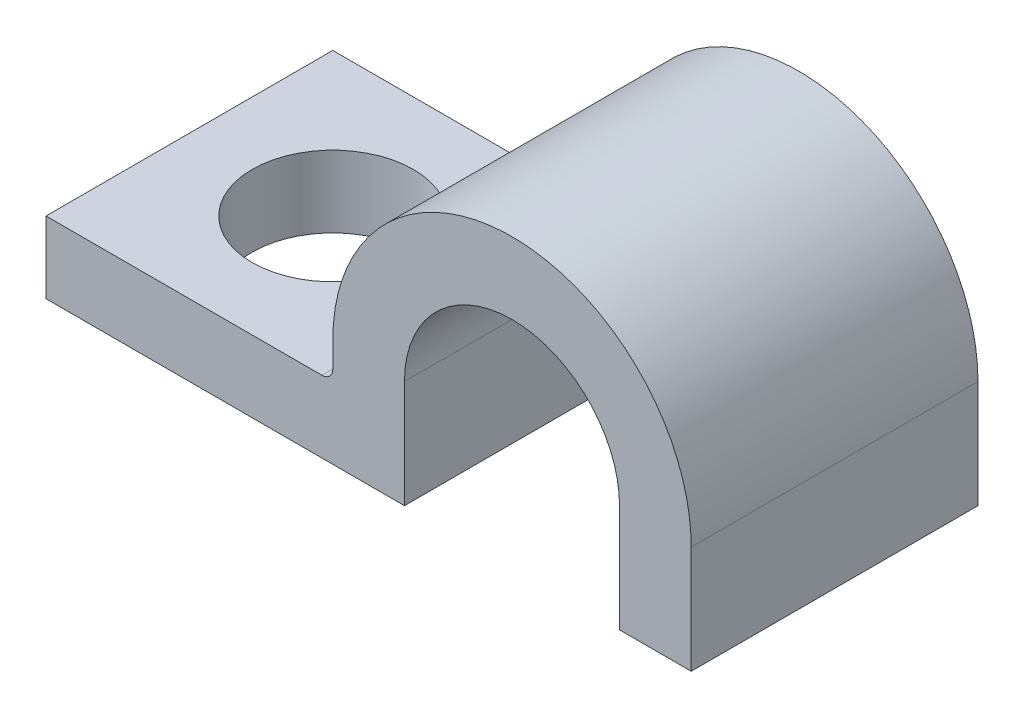
ISO-10303-21;
HEADER;
FILE_DESCRIPTION(('STEP AP214'),'2;1');
FILE_NAME('part.step','',(''),(''),'','','');
FILE_SCHEMA(('AUTOMOTIVE_DESIGN { 1 0 10303 214 1 1 1 1 }'));
ENDSEC;
DATA;
#1=APPLICATION_CONTEXT('core data for automotive mechanical design processes');
#2=APPLICATION_PROTOCOL_DEFINITION('international standard','automotive_design',2000,#1);
#3=PRODUCT_CONTEXT('',#1,'mechanical');
#4=PRODUCT('Part','Part','',(#3));
#5=PRODUCT_RELATED_PRODUCT_CATEGORY('part','',(#4));
#6=PRODUCT_DEFINITION_FORMATION('','',#4);
#7=PRODUCT_DEFINITION_CONTEXT('part definition',#1,'design');
#8=PRODUCT_DEFINITION('design','',#6,#7);
#9=PRODUCT_DEFINITION_SHAPE('','',#8);
#10=(LENGTH_UNIT() NAMED_UNIT(*) SI_UNIT(.MILLI.,.METRE.));
#11=(NAMED_UNIT(*) PLANE_ANGLE_UNIT() SI_UNIT($,.RADIAN.));
#12=(NAMED_UNIT(*) SI_UNIT($,.STERADIAN.) SOLID_ANGLE_UNIT());
#13=UNCERTAINTY_MEASURE_WITH_UNIT(LENGTH_MEASURE(1.E-05),#10,'distance_accuracy_value','');
#14=(GEOMETRIC_REPRESENTATION_CONTEXT(3) GLOBAL_UNCERTAINTY_ASSIGNED_CONTEXT((#13)) GLOBAL_UNIT_ASSIGNED_CONTEXT((#10,
#11,#12)) REPRESENTATION_CONTEXT('',''));
#15=CARTESIAN_POINT('',(0.,0.,0.));
#16=DIRECTION('',(0.,0.,1.));
#17=DIRECTION('',(1.,0.,0.));
#18=AXIS2_PLACEMENT_3D('',#15,#16,#17);
#19=CARTESIAN_POINT('',(0.,0.,7.99999999999995));
#20=DIRECTION('',(1.,0.,0.));
#21=DIRECTION('',(0.,0.,-1.));
#22=AXIS2_PLACEMENT_3D('',#19,#20,#21);
#23=PLANE('',#22);
#24=DIRECTION('',(0.,-1.,0.));
#25=VECTOR('',#24,1.);
#26=CARTESIAN_POINT('',(0.,0.,0.));
#27=LINE('',#26,#25);
#28=CARTESIAN_POINT('',(0.,1.99999999999989,0.));
#29=VERTEX_POINT('',#28);
#30=CARTESIAN_POINT('',(0.,0.,0.));
#31=VERTEX_POINT('',#30);
#32=EDGE_CURVE('E115',#29,#31,#27,.T.);
#33=ORIENTED_EDGE('',*,*,#32,.T.);
#34=DIRECTION('',(0.,0.,-1.));
#35=VECTOR('',#34,1.);
#36=CARTESIAN_POINT('',(0.,0.,7.99999999999995));
#37=LINE('',#36,#35);
#38=CARTESIAN_POINT('',(0.,0.,7.99999999999995));
#39=VERTEX_POINT('',#38);
#40=EDGE_CURVE('E123',#39,#31,#37,.T.);
#41=ORIENTED_EDGE('',*,*,#40,.F.);
#42=DIRECTION('',(0.,-1.,0.));
#43=VECTOR('',#42,1.);
#44=CARTESIAN_POINT('',(0.,0.,7.99999999999995));
#45=LINE('',#44,#43);
#46=CARTESIAN_POINT('',(0.,1.9999999999999,7.99999999999995));
#47=VERTEX_POINT('',#46);
#48=EDGE_CURVE('E157',#47,#39,#45,.T.);
#49=ORIENTED_EDGE('',*,*,#48,.F.);
#50=DIRECTION('',(0.,0.,-1.));
#51=VECTOR('',#50,1.);
#52=CARTESIAN_POINT('',(0.,1.9999999999999,7.99999999999995));
#53=LINE('',#52,#51);
#54=EDGE_CURVE('E134',#47,#29,#53,.T.);
#55=ORIENTED_EDGE('',*,*,#54,.T.);
#56=EDGE_LOOP('',(#33,#41,#49,#55));
#57=FACE_BOUND('',#56,.T.);
#58=ADVANCED_FACE('F30',(#57),#23,.F.);
#59=CARTESIAN_POINT('',(0.,0.,7.99999999999995));
#60=DIRECTION('',(0.,1.,0.));
#61=DIRECTION('',(-1.,0.,0.));
#62=AXIS2_PLACEMENT_3D('',#59,#60,#61);
#63=PLANE('',#62);
#64=CARTESIAN_POINT('',(4.00000000000001,0.,4.));
#65=DIRECTION('',(0.,1.,0.));
#66=DIRECTION('',(-1.,0.,0.));
#67=AXIS2_PLACEMENT_3D('',#64,#65,#66);
#68=CIRCLE('',#67,2.25);
#69=CARTESIAN_POINT('',(1.75000000000001,0.,4.));
#70=VERTEX_POINT('',#69);
#71=EDGE_CURVE('E135',#70,#70,#68,.T.);
#72=ORIENTED_EDGE('',*,*,#71,.T.);
#73=EDGE_LOOP('',(#72));
#74=FACE_BOUND('',#73,.T.);
#75=DIRECTION('',(1.,0.,0.));
#76=VECTOR('',#75,1.);
#77=CARTESIAN_POINT('',(0.,0.,0.));
#78=LINE('',#77,#76);
#79=CARTESIAN_POINT('',(10.,0.,0.));
#80=VERTEX_POINT('',#79);
#81=EDGE_CURVE('E111',#31,#80,#78,.T.);
#82=ORIENTED_EDGE('',*,*,#81,.T.);
#83=DIRECTION('',(0.,0.,-1.));
#84=VECTOR('',#83,1.);
#85=CARTESIAN_POINT('',(9.99999999999998,0.,8.00000000000006));
#86=LINE('',#85,#84);
#87=CARTESIAN_POINT('',(9.99999999999998,0.,8.00000000000006));
#88=VERTEX_POINT('',#87);
#89=EDGE_CURVE('E130',#88,#80,#86,.T.);
#90=ORIENTED_EDGE('',*,*,#89,.F.);
#91=DIRECTION('',(1.,0.,0.));
#92=VECTOR('',#91,1.);
#93=CARTESIAN_POINT('',(0.,0.,7.99999999999995));
#94=LINE('',#93,#92);
#95=EDGE_CURVE('E125',#39,#88,#94,.T.);
#96=ORIENTED_EDGE('',*,*,#95,.F.);
#97=ORIENTED_EDGE('',*,*,#40,.T.);
#98=EDGE_LOOP('',(#82,#90,#96,#97));
#99=FACE_BOUND('',#98,.T.);
#100=ADVANCED_FACE('F124',(#74,#99),#63,.F.);
#101=CARTESIAN_POINT('',(9.99999999999998,0.,8.00000000000006));
#102=DIRECTION('',(-1.,0.,0.));
#103=DIRECTION('',(0.,-1.,0.));
#104=AXIS2_PLACEMENT_3D('',#101,#102,#103);
#105=PLANE('',#104);
#106=DIRECTION('',(0.,1.,0.));
#107=VECTOR('',#106,1.);
#108=CARTESIAN_POINT('',(10.,0.,0.));
#109=LINE('',#108,#107);
#110=CARTESIAN_POINT('',(10.,2.99999999999992,0.));
#111=VERTEX_POINT('',#110);
#112=EDGE_CURVE('E117',#80,#111,#109,.T.);
#113=ORIENTED_EDGE('',*,*,#112,.T.);
#114=DIRECTION('',(0.,0.,-1.));
#115=VECTOR('',#114,1.);
#116=CARTESIAN_POINT('',(10.,2.99999999999992,7.99999999999998));
#117=LINE('',#116,#115);
#118=CARTESIAN_POINT('',(10.,2.99999999999992,7.99999999999998));
#119=VERTEX_POINT('',#118);
#120=EDGE_CURVE('E192',#119,#111,#117,.T.);
#121=ORIENTED_EDGE('',*,*,#120,.F.);
#122=DIRECTION('',(0.,1.,0.));
#123=VECTOR('',#122,1.);
#124=CARTESIAN_POINT('',(9.99999999999998,0.,8.00000000000006));
#125=LINE('',#124,#123);
#126=EDGE_CURVE('E160',#88,#119,#125,.T.);
#127=ORIENTED_EDGE('',*,*,#126,.F.);
#128=ORIENTED_EDGE('',*,*,#89,.T.);
#129=EDGE_LOOP('',(#113,#121,#127,#128));
#130=FACE_BOUND('',#129,.T.);
#131=ADVANCED_FACE('F235',(#130),#105,.F.);
#132=CARTESIAN_POINT('',(13.,2.99999999999992,8.00000000000009));
#133=DIRECTION('',(0.,0.,-1.));
#134=DIRECTION('',(-1.,0.,0.));
#135=AXIS2_PLACEMENT_3D('',#132,#133,#134);
#136=CYLINDRICAL_SURFACE('',#135,3.);
#137=CARTESIAN_POINT('',(13.,2.99999999999998,0.));
#138=DIRECTION('',(0.,0.,-1.));
#139=DIRECTION('',(-1.,0.,0.));
#140=AXIS2_PLACEMENT_3D('',#137,#138,#139);
#141=CIRCLE('',#140,3.);
#142=CARTESIAN_POINT('',(16.,2.99999999999992,0.));
#143=VERTEX_POINT('',#142);
#144=EDGE_CURVE('E143',#111,#143,#141,.T.);
#145=ORIENTED_EDGE('',*,*,#144,.T.);
#146=DIRECTION('',(0.,0.,-1.));
#147=VECTOR('',#146,1.);
#148=CARTESIAN_POINT('',(16.,2.99999999999992,8.00000000000002));
#149=LINE('',#148,#147);
#150=CARTESIAN_POINT('',(16.,2.99999999999992,8.00000000000002));
#151=VERTEX_POINT('',#150);
#152=EDGE_CURVE('E189',#151,#143,#149,.T.);
#153=ORIENTED_EDGE('',*,*,#152,.F.);
#154=CARTESIAN_POINT('',(13.,2.99999999999992,8.00000000000009));
#155=DIRECTION('',(0.,0.,-1.));
#156=DIRECTION('',(-1.,0.,0.));
#157=AXIS2_PLACEMENT_3D('',#154,#155,#156);
#158=CIRCLE('',#157,3.);
#159=EDGE_CURVE('E162',#119,#151,#158,.T.);
#160=ORIENTED_EDGE('',*,*,#159,.F.);
#161=ORIENTED_EDGE('',*,*,#120,.T.);
#162=EDGE_LOOP('',(#145,#153,#160,#161));
#163=FACE_BOUND('',#162,.T.);
#164=ADVANCED_FACE('F231',(#163),#136,.F.);
#165=CARTESIAN_POINT('',(16.,2.99999999999992,8.00000000000002));
#166=DIRECTION('',(1.,0.,0.));
#167=DIRECTION('',(0.,0.,-1.));
#168=AXIS2_PLACEMENT_3D('',#165,#166,#167);
#169=PLANE('',#168);
#170=DIRECTION('',(0.,-1.,0.));
#171=VECTOR('',#170,1.);
#172=CARTESIAN_POINT('',(16.,2.99999999999992,0.));
#173=LINE('',#172,#171);
#174=CARTESIAN_POINT('',(16.,-1.2490009027033E-13,0.));
#175=VERTEX_POINT('',#174);
#176=EDGE_CURVE('E145',#143,#175,#173,.T.);
#177=ORIENTED_EDGE('',*,*,#176,.T.);
#178=DIRECTION('',(0.,0.,-1.));
#179=VECTOR('',#178,1.);
#180=CARTESIAN_POINT('',(16.,-1.2490009027033E-13,8.00000000000005));
#181=LINE('',#180,#179);
#182=CARTESIAN_POINT('',(16.,-1.2490009027033E-13,8.00000000000005));
#183=VERTEX_POINT('',#182);
#184=EDGE_CURVE('E186',#183,#175,#181,.T.);
#185=ORIENTED_EDGE('',*,*,#184,.F.);
#186=DIRECTION('',(0.,-1.,0.));
#187=VECTOR('',#186,1.);
#188=CARTESIAN_POINT('',(16.,2.99999999999992,8.00000000000002));
#189=LINE('',#188,#187);
#190=EDGE_CURVE('E164',#151,#183,#189,.T.);
#191=ORIENTED_EDGE('',*,*,#190,.F.);
#192=ORIENTED_EDGE('',*,*,#152,.T.);
#193=EDGE_LOOP('',(#177,#185,#191,#192));
#194=FACE_BOUND('',#193,.T.);
#195=ADVANCED_FACE('F226',(#194),#169,.F.);
#196=CARTESIAN_POINT('',(18.,0.,8.00000000000006));
#197=DIRECTION('',(0.,1.,0.));
#198=DIRECTION('',(-1.,0.,0.));
#199=AXIS2_PLACEMENT_3D('',#196,#197,#198);
#200=PLANE('',#199);
#201=DIRECTION('',(1.,0.,0.));
#202=VECTOR('',#201,1.);
#203=CARTESIAN_POINT('',(18.,0.,0.));
#204=LINE('',#203,#202);
#205=CARTESIAN_POINT('',(18.,0.,0.));
#206=VERTEX_POINT('',#205);
#207=EDGE_CURVE('E147',#175,#206,#204,.T.);
#208=ORIENTED_EDGE('',*,*,#207,.T.);
#209=DIRECTION('',(0.,0.,-1.));
#210=VECTOR('',#209,1.);
#211=CARTESIAN_POINT('',(18.,0.,8.00000000000006));
#212=LINE('',#211,#210);
#213=CARTESIAN_POINT('',(18.,0.,8.00000000000006));
#214=VERTEX_POINT('',#213);
#215=EDGE_CURVE('E183',#214,#206,#212,.T.);
#216=ORIENTED_EDGE('',*,*,#215,.F.);
#217=DIRECTION('',(1.,0.,0.));
#218=VECTOR('',#217,1.);
#219=CARTESIAN_POINT('',(18.,0.,8.00000000000006));
#220=LINE('',#219,#218);
#221=EDGE_CURVE('E166',#183,#214,#220,.T.);
#222=ORIENTED_EDGE('',*,*,#221,.F.);
#223=ORIENTED_EDGE('',*,*,#184,.T.);
#224=EDGE_LOOP('',(#208,#216,#222,#223));
#225=FACE_BOUND('',#224,.T.);
#226=ADVANCED_FACE('F222',(#225),#200,.F.);
#227=CARTESIAN_POINT('',(18.,2.99999999999995,7.99999999999999));
#228=DIRECTION('',(-1.,0.,0.));
#229=DIRECTION('',(0.,-1.,0.));
#230=AXIS2_PLACEMENT_3D('',#227,#228,#229);
#231=PLANE('',#230);
#232=DIRECTION('',(0.,1.,0.));
#233=VECTOR('',#232,1.);
#234=CARTESIAN_POINT('',(18.0000000000001,2.99999999999998,0.));
#235=LINE('',#234,#233);
#236=CARTESIAN_POINT('',(18.0000000000001,2.99999999999998,0.));
#237=VERTEX_POINT('',#236);
#238=EDGE_CURVE('E149',#206,#237,#235,.T.);
#239=ORIENTED_EDGE('',*,*,#238,.T.);
#240=DIRECTION('',(0.,0.,-1.));
#241=VECTOR('',#240,1.);
#242=CARTESIAN_POINT('',(18.,2.99999999999995,7.99999999999999));
#243=LINE('',#242,#241);
#244=CARTESIAN_POINT('',(18.,2.99999999999995,7.99999999999999));
#245=VERTEX_POINT('',#244);
#246=EDGE_CURVE('E180',#245,#237,#243,.T.);
#247=ORIENTED_EDGE('',*,*,#246,.F.);
#248=DIRECTION('',(0.,1.,0.));
#249=VECTOR('',#248,1.);
#250=CARTESIAN_POINT('',(18.,2.99999999999995,7.99999999999999));
#251=LINE('',#250,#249);
#252=EDGE_CURVE('E168',#214,#245,#251,.T.);
#253=ORIENTED_EDGE('',*,*,#252,.F.);
#254=ORIENTED_EDGE('',*,*,#215,.T.);
#255=EDGE_LOOP('',(#239,#247,#253,#254));
#256=FACE_BOUND('',#255,.T.);
#257=ADVANCED_FACE('F218',(#256),#231,.F.);
#258=CARTESIAN_POINT('',(13.,2.99999999999992,8.00000000000009));
#259=DIRECTION('',(0.,0.,-1.));
#260=DIRECTION('',(-1.,0.,0.));
#261=AXIS2_PLACEMENT_3D('',#258,#259,#260);
#262=CYLINDRICAL_SURFACE('',#261,5.);
#263=CARTESIAN_POINT('',(13.,2.99999999999998,0.));
#264=DIRECTION('',(0.,0.,1.));
#265=DIRECTION('',(-1.,0.,0.));
#266=AXIS2_PLACEMENT_3D('',#263,#264,#265);
#267=CIRCLE('',#266,5.);
#268=CARTESIAN_POINT('',(8.,2.99999999999999,0.));
#269=VERTEX_POINT('',#268);
#270=EDGE_CURVE('E151',#237,#269,#267,.T.);
#271=ORIENTED_EDGE('',*,*,#270,.T.);
#272=DIRECTION('',(0.,0.,-1.));
#273=VECTOR('',#272,1.);
#274=CARTESIAN_POINT('',(8.00000000000003,2.99999999999999,7.99999999999995));
#275=LINE('',#274,#273);
#276=CARTESIAN_POINT('',(8.00000000000003,2.99999999999999,7.99999999999995));
#277=VERTEX_POINT('',#276);
#278=EDGE_CURVE('E177',#277,#269,#275,.T.);
#279=ORIENTED_EDGE('',*,*,#278,.F.);
#280=CARTESIAN_POINT('',(13.,2.99999999999992,8.00000000000009));
#281=DIRECTION('',(0.,0.,1.));
#282=DIRECTION('',(-1.,0.,0.));
#283=AXIS2_PLACEMENT_3D('',#280,#281,#282);
#284=CIRCLE('',#283,5.);
#285=EDGE_CURVE('E170',#245,#277,#284,.T.);
#286=ORIENTED_EDGE('',*,*,#285,.F.);
#287=ORIENTED_EDGE('',*,*,#246,.T.);
#288=EDGE_LOOP('',(#271,#279,#286,#287));
#289=FACE_BOUND('',#288,.T.);
#290=ADVANCED_FACE('F214',(#289),#262,.T.);
#291=CARTESIAN_POINT('',(8.00000000000004,1.99999999999996,7.99999999999998));
#292=DIRECTION('',(1.,0.,0.));
#293=DIRECTION('',(0.,1.,0.));
#294=AXIS2_PLACEMENT_3D('',#291,#292,#293);
#295=PLANE('',#294);
#296=DIRECTION('',(0.,-1.,0.));
#297=VECTOR('',#296,1.);
#298=CARTESIAN_POINT('',(8.00000000000004,1.99999999999997,0.));
#299=LINE('',#298,#297);
#300=CARTESIAN_POINT('',(8.00000000000004,2.2999999999999,0.));
#301=VERTEX_POINT('',#300);
#302=EDGE_CURVE('E153',#269,#301,#299,.T.);
#303=ORIENTED_EDGE('',*,*,#302,.T.);
#304=DIRECTION('',(0.,0.,-1.));
#305=VECTOR('',#304,1.);
#306=CARTESIAN_POINT('',(8.00000000000004,2.29999999999989,7.99999999999998));
#307=LINE('',#306,#305);
#308=CARTESIAN_POINT('',(8.00000000000004,2.29999999999989,7.99999999999998));
#309=VERTEX_POINT('',#308);
#310=EDGE_CURVE('E44',#301,#309,#307,.F.);
#311=ORIENTED_EDGE('',*,*,#310,.T.);
#312=DIRECTION('',(0.,-1.,0.));
#313=VECTOR('',#312,1.);
#314=CARTESIAN_POINT('',(8.00000000000004,1.99999999999996,7.99999999999998));
#315=LINE('',#314,#313);
#316=EDGE_CURVE('E172',#277,#309,#315,.T.);
#317=ORIENTED_EDGE('',*,*,#316,.F.);
#318=ORIENTED_EDGE('',*,*,#278,.T.);
#319=EDGE_LOOP('',(#303,#311,#317,#318));
#320=FACE_BOUND('',#319,.T.);
#321=ADVANCED_FACE('F209',(#320),#295,.F.);
#322=CARTESIAN_POINT('',(0.,1.9999999999999,7.99999999999995));
#323=DIRECTION('',(0.,-1.,0.));
#324=DIRECTION('',(1.,0.,0.));
#325=AXIS2_PLACEMENT_3D('',#322,#323,#324);
#326=PLANE('',#325);
#327=CARTESIAN_POINT('',(4.00000000000002,1.99999999999992,3.99999999999996));
#328=DIRECTION('',(0.,1.,0.));
#329=DIRECTION('',(-1.,0.,0.));
#330=AXIS2_PLACEMENT_3D('',#327,#328,#329);
#331=CIRCLE('',#330,2.25);
#332=CARTESIAN_POINT('',(1.75000000000002,1.99999999999992,3.99999999999996));
#333=VERTEX_POINT('',#332);
#334=EDGE_CURVE('E138',#333,#333,#331,.T.);
#335=ORIENTED_EDGE('',*,*,#334,.F.);
#336=EDGE_LOOP('',(#335));
#337=FACE_BOUND('',#336,.T.);
#338=DIRECTION('',(-1.,0.,0.));
#339=VECTOR('',#338,1.);
#340=CARTESIAN_POINT('',(0.,1.9999999999999,7.99999999999995));
#341=LINE('',#340,#339);
#342=CARTESIAN_POINT('',(7.7,1.99999999999992,7.99999999999998));
#343=VERTEX_POINT('',#342);
#344=EDGE_CURVE('E174',#343,#47,#341,.T.);
#345=ORIENTED_EDGE('',*,*,#344,.F.);
#346=DIRECTION('',(0.,0.,-1.));
#347=VECTOR('',#346,1.);
#348=CARTESIAN_POINT('',(7.7,2.,0.));
#349=LINE('',#348,#347);
#350=CARTESIAN_POINT('',(7.7,2.,0.));
#351=VERTEX_POINT('',#350);
#352=EDGE_CURVE('E129',#343,#351,#349,.T.);
#353=ORIENTED_EDGE('',*,*,#352,.T.);
#354=DIRECTION('',(-1.,0.,0.));
#355=VECTOR('',#354,1.);
#356=CARTESIAN_POINT('',(0.,1.99999999999989,0.));
#357=LINE('',#356,#355);
#358=EDGE_CURVE('E155',#351,#29,#357,.T.);
#359=ORIENTED_EDGE('',*,*,#358,.T.);
#360=ORIENTED_EDGE('',*,*,#54,.F.);
#361=EDGE_LOOP('',(#345,#353,#359,#360));
#362=FACE_BOUND('',#361,.T.);
#363=ADVANCED_FACE('F201',(#337,#362),#326,.F.);
#364=CARTESIAN_POINT('',(13.,2.99999999999992,8.00000000000009));
#365=DIRECTION('',(0.,0.,-1.));
#366=DIRECTION('',(-1.,0.,0.));
#367=AXIS2_PLACEMENT_3D('',#364,#365,#366);
#368=PLANE('',#367);
#369=ORIENTED_EDGE('',*,*,#48,.T.);
#370=ORIENTED_EDGE('',*,*,#95,.T.);
#371=ORIENTED_EDGE('',*,*,#126,.T.);
#372=ORIENTED_EDGE('',*,*,#159,.T.);
#373=ORIENTED_EDGE('',*,*,#190,.T.);
#374=ORIENTED_EDGE('',*,*,#221,.T.);
#375=ORIENTED_EDGE('',*,*,#252,.T.);
#376=ORIENTED_EDGE('',*,*,#285,.T.);
#377=ORIENTED_EDGE('',*,*,#316,.T.);
#378=CARTESIAN_POINT('',(7.7,2.29999999999991,8.00000000000001));
#379=DIRECTION('',(0.,0.,-1.));
#380=DIRECTION('',(-1.,0.,0.));
#381=AXIS2_PLACEMENT_3D('',#378,#379,#380);
#382=CIRCLE('',#381,0.3);
#383=EDGE_CURVE('E11',#309,#343,#382,.T.);
#384=ORIENTED_EDGE('',*,*,#383,.T.);
#385=ORIENTED_EDGE('',*,*,#344,.T.);
#386=EDGE_LOOP('',(#369,#370,#371,#372,#373,#374,#375,#376,#377,#384,#385));
#387=FACE_BOUND('',#386,.T.);
#388=ADVANCED_FACE('F206',(#387),#368,.F.);
#389=CARTESIAN_POINT('',(13.,2.99999999999998,0.));
#390=DIRECTION('',(0.,0.,-1.));
#391=DIRECTION('',(-1.,0.,0.));
#392=AXIS2_PLACEMENT_3D('',#389,#390,#391);
#393=PLANE('',#392);
#394=ORIENTED_EDGE('',*,*,#32,.F.);
#395=ORIENTED_EDGE('',*,*,#358,.F.);
#396=CARTESIAN_POINT('',(7.70000000000001,2.29999999999991,0.));
#397=DIRECTION('',(0.,0.,-1.));
#398=DIRECTION('',(-1.,0.,0.));
#399=AXIS2_PLACEMENT_3D('',#396,#397,#398);
#400=CIRCLE('',#399,0.3);
#401=EDGE_CURVE('E37',#351,#301,#400,.F.);
#402=ORIENTED_EDGE('',*,*,#401,.T.);
#403=ORIENTED_EDGE('',*,*,#302,.F.);
#404=ORIENTED_EDGE('',*,*,#270,.F.);
#405=ORIENTED_EDGE('',*,*,#238,.F.);
#406=ORIENTED_EDGE('',*,*,#207,.F.);
#407=ORIENTED_EDGE('',*,*,#176,.F.);
#408=ORIENTED_EDGE('',*,*,#144,.F.);
#409=ORIENTED_EDGE('',*,*,#112,.F.);
#410=ORIENTED_EDGE('',*,*,#81,.F.);
#411=EDGE_LOOP('',(#394,#395,#402,#403,#404,#405,#406,#407,#408,#409,#410));
#412=FACE_BOUND('',#411,.T.);
#413=ADVANCED_FACE('F113',(#412),#393,.T.);
#414=CARTESIAN_POINT('',(4.00000000000001,0.,4.));
#415=DIRECTION('',(0.,1.,0.));
#416=DIRECTION('',(-1.,0.,0.));
#417=AXIS2_PLACEMENT_3D('',#414,#415,#416);
#418=CYLINDRICAL_SURFACE('',#417,2.25);
#419=ORIENTED_EDGE('',*,*,#71,.F.);
#420=EDGE_LOOP('',(#419));
#421=FACE_BOUND('',#420,.T.);
#422=ORIENTED_EDGE('',*,*,#334,.T.);
#423=EDGE_LOOP('',(#422));
#424=FACE_BOUND('',#423,.T.);
#425=ADVANCED_FACE('F327',(#421,#424),#418,.F.);
#426=CARTESIAN_POINT('',(7.7,2.29999999999991,8.00000000000001));
#427=DIRECTION('',(0.,0.,1.));
#428=DIRECTION('',(1.,0.,0.));
#429=AXIS2_PLACEMENT_3D('',#426,#427,#428);
#430=CYLINDRICAL_SURFACE('',#429,0.3);
#431=ORIENTED_EDGE('',*,*,#383,.F.);
#432=ORIENTED_EDGE('',*,*,#310,.F.);
#433=ORIENTED_EDGE('',*,*,#401,.F.);
#434=ORIENTED_EDGE('',*,*,#352,.F.);
#435=EDGE_LOOP('',(#431,#432,#433,#434));
#436=FACE_BOUND('',#435,.T.);
#437=ADVANCED_FACE('F204',(#436),#430,.F.);
#438=CLOSED_SHELL('',(#58,#100,#131,#164,#195,#226,#257,#290,#321,#363,#388,#413,#425,#437));
#439=MANIFOLD_SOLID_BREP('B2',#438);
#440=ADVANCED_BREP_SHAPE_REPRESENTATION('',(#18,#439),#14);
#441=SHAPE_DEFINITION_REPRESENTATION(#9,#440);
ENDSEC;
END-ISO-10303-21;
